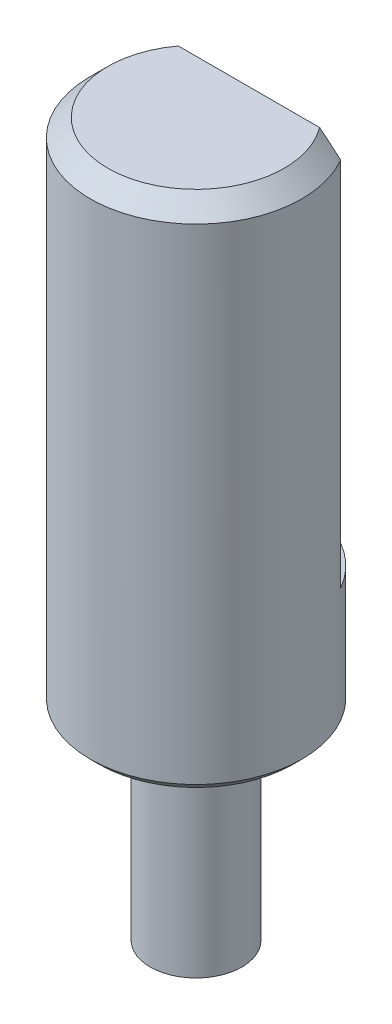
ISO-10303-21;
HEADER;
FILE_DESCRIPTION(('STEP AP214'),'2;1');
FILE_NAME('part.step','',(''),(''),'','','');
FILE_SCHEMA(('AUTOMOTIVE_DESIGN { 1 0 10303 214 1 1 1 1 }'));
ENDSEC;
DATA;
#1=APPLICATION_CONTEXT('core data for automotive mechanical design processes');
#2=APPLICATION_PROTOCOL_DEFINITION('international standard','automotive_design',2000,#1);
#3=PRODUCT_CONTEXT('',#1,'mechanical');
#4=PRODUCT('Part','Part','',(#3));
#5=PRODUCT_RELATED_PRODUCT_CATEGORY('part','',(#4));
#6=PRODUCT_DEFINITION_FORMATION('','',#4);
#7=PRODUCT_DEFINITION_CONTEXT('part definition',#1,'design');
#8=PRODUCT_DEFINITION('design','',#6,#7);
#9=PRODUCT_DEFINITION_SHAPE('','',#8);
#10=(LENGTH_UNIT() NAMED_UNIT(*) SI_UNIT(.MILLI.,.METRE.));
#11=(NAMED_UNIT(*) PLANE_ANGLE_UNIT() SI_UNIT($,.RADIAN.));
#12=(NAMED_UNIT(*) SI_UNIT($,.STERADIAN.) SOLID_ANGLE_UNIT());
#13=UNCERTAINTY_MEASURE_WITH_UNIT(LENGTH_MEASURE(1.E-05),#10,'distance_accuracy_value','');
#14=(GEOMETRIC_REPRESENTATION_CONTEXT(3) GLOBAL_UNCERTAINTY_ASSIGNED_CONTEXT((#13)) GLOBAL_UNIT_ASSIGNED_CONTEXT((#10,
#11,#12)) REPRESENTATION_CONTEXT('',''));
#15=CARTESIAN_POINT('',(0.,0.,0.));
#16=DIRECTION('',(0.,0.,1.));
#17=DIRECTION('',(1.,0.,0.));
#18=AXIS2_PLACEMENT_3D('',#15,#16,#17);
#19=CARTESIAN_POINT('',(0.,5.7,0.));
#20=DIRECTION('',(0.,-1.,0.));
#21=DIRECTION('',(0.,0.,-1.));
#22=AXIS2_PLACEMENT_3D('',#19,#20,#21);
#23=CYLINDRICAL_SURFACE('',#22,1.3);
#24=CARTESIAN_POINT('',(0.,5.7,0.));
#25=DIRECTION('',(0.,1.,0.));
#26=DIRECTION('',(0.,0.,1.));
#27=AXIS2_PLACEMENT_3D('',#24,#25,#26);
#28=CIRCLE('',#27,1.3);
#29=CARTESIAN_POINT('',(0.,5.7,1.3));
#30=VERTEX_POINT('',#29);
#31=EDGE_CURVE('E85',#30,#30,#28,.T.);
#32=ORIENTED_EDGE('',*,*,#31,.F.);
#33=EDGE_LOOP('',(#32));
#34=FACE_BOUND('',#33,.T.);
#35=CARTESIAN_POINT('',(0.,0.,0.));
#36=DIRECTION('',(0.,1.,0.));
#37=DIRECTION('',(0.,0.,1.));
#38=AXIS2_PLACEMENT_3D('',#35,#36,#37);
#39=CIRCLE('',#38,1.3);
#40=CARTESIAN_POINT('',(0.,0.,1.3));
#41=VERTEX_POINT('',#40);
#42=EDGE_CURVE('E81',#41,#41,#39,.T.);
#43=ORIENTED_EDGE('',*,*,#42,.T.);
#44=EDGE_LOOP('',(#43));
#45=FACE_BOUND('',#44,.T.);
#46=ADVANCED_FACE('F33',(#34,#45),#23,.T.);
#47=CARTESIAN_POINT('',(0.,0.,0.));
#48=DIRECTION('',(0.,1.,0.));
#49=DIRECTION('',(0.,0.,1.));
#50=AXIS2_PLACEMENT_3D('',#47,#48,#49);
#51=PLANE('',#50);
#52=ORIENTED_EDGE('',*,*,#42,.F.);
#53=EDGE_LOOP('',(#52));
#54=FACE_BOUND('',#53,.T.);
#55=ADVANCED_FACE('F123',(#54),#51,.F.);
#56=CARTESIAN_POINT('',(0.,20.2,0.));
#57=DIRECTION('',(0.,-1.,0.));
#58=DIRECTION('',(0.,0.,-1.));
#59=AXIS2_PLACEMENT_3D('',#56,#57,#58);
#60=CYLINDRICAL_SURFACE('',#59,3.);
#61=DIRECTION('',(0.,1.,0.));
#62=VECTOR('',#61,1.);
#63=CARTESIAN_POINT('',(2.59807621135332,9.2,-1.5));
#64=LINE('',#63,#62);
#65=CARTESIAN_POINT('',(2.59807621135332,9.2,-1.5));
#66=VERTEX_POINT('',#65);
#67=CARTESIAN_POINT('',(2.59807621135332,19.7,-1.5));
#68=VERTEX_POINT('',#67);
#69=EDGE_CURVE('E76',#66,#68,#64,.T.);
#70=ORIENTED_EDGE('',*,*,#69,.T.);
#71=CARTESIAN_POINT('',(0.,19.7,0.));
#72=DIRECTION('',(0.,1.,0.));
#73=DIRECTION('',(0.,0.,1.));
#74=AXIS2_PLACEMENT_3D('',#71,#72,#73);
#75=CIRCLE('',#74,3.);
#76=CARTESIAN_POINT('',(-2.59807621135332,19.7,-1.5));
#77=VERTEX_POINT('',#76);
#78=EDGE_CURVE('E11',#68,#77,#75,.F.);
#79=ORIENTED_EDGE('',*,*,#78,.T.);
#80=DIRECTION('',(0.,1.,0.));
#81=VECTOR('',#80,1.);
#82=CARTESIAN_POINT('',(-2.59807621135332,9.2,-1.5));
#83=LINE('',#82,#81);
#84=CARTESIAN_POINT('',(-2.59807621135332,9.2,-1.5));
#85=VERTEX_POINT('',#84);
#86=EDGE_CURVE('E74',#85,#77,#83,.T.);
#87=ORIENTED_EDGE('',*,*,#86,.F.);
#88=CARTESIAN_POINT('',(0.,9.2,0.));
#89=DIRECTION('',(0.,1.,0.));
#90=DIRECTION('',(0.,0.,1.));
#91=AXIS2_PLACEMENT_3D('',#88,#89,#90);
#92=CIRCLE('',#91,3.);
#93=EDGE_CURVE('E67',#66,#85,#92,.T.);
#94=ORIENTED_EDGE('',*,*,#93,.F.);
#95=EDGE_LOOP('',(#70,#79,#87,#94));
#96=FACE_BOUND('',#95,.T.);
#97=CARTESIAN_POINT('',(0.,5.95000000000001,0.));
#98=DIRECTION('',(0.,1.,0.));
#99=DIRECTION('',(0.,0.,1.));
#100=AXIS2_PLACEMENT_3D('',#97,#98,#99);
#101=CIRCLE('',#100,3.);
#102=CARTESIAN_POINT('',(0.,5.95000000000001,3.));
#103=VERTEX_POINT('',#102);
#104=EDGE_CURVE('E88',#103,#103,#101,.T.);
#105=ORIENTED_EDGE('',*,*,#104,.T.);
#106=EDGE_LOOP('',(#105));
#107=FACE_BOUND('',#106,.T.);
#108=ADVANCED_FACE('F78',(#96,#107),#60,.T.);
#109=CARTESIAN_POINT('',(0.,20.2,0.));
#110=DIRECTION('',(0.,1.,0.));
#111=DIRECTION('',(0.,0.,1.));
#112=AXIS2_PLACEMENT_3D('',#109,#110,#111);
#113=PLANE('',#112);
#114=DIRECTION('',(1.,0.,0.));
#115=VECTOR('',#114,1.);
#116=CARTESIAN_POINT('',(-2.59807621135332,20.2,-1.5));
#117=LINE('',#116,#115);
#118=CARTESIAN_POINT('',(-2.00000000000001,20.2,-1.5));
#119=VERTEX_POINT('',#118);
#120=CARTESIAN_POINT('',(2.00000000000001,20.2,-1.5));
#121=VERTEX_POINT('',#120);
#122=EDGE_CURVE('E71',#119,#121,#117,.T.);
#123=ORIENTED_EDGE('',*,*,#122,.F.);
#124=CARTESIAN_POINT('',(0.,20.2,0.));
#125=DIRECTION('',(0.,1.,0.));
#126=DIRECTION('',(0.,0.,1.));
#127=AXIS2_PLACEMENT_3D('',#124,#125,#126);
#128=CIRCLE('',#127,2.50000000000001);
#129=EDGE_CURVE('E96',#119,#121,#128,.T.);
#130=ORIENTED_EDGE('',*,*,#129,.T.);
#131=EDGE_LOOP('',(#123,#130));
#132=FACE_BOUND('',#131,.T.);
#133=ADVANCED_FACE('F112',(#132),#113,.T.);
#134=CARTESIAN_POINT('',(0.,5.7,0.));
#135=DIRECTION('',(0.,1.,0.));
#136=DIRECTION('',(0.,0.,1.));
#137=AXIS2_PLACEMENT_3D('',#134,#135,#136);
#138=PLANE('',#137);
#139=CARTESIAN_POINT('',(0.,5.7,0.));
#140=DIRECTION('',(0.,1.,0.));
#141=DIRECTION('',(0.,0.,1.));
#142=AXIS2_PLACEMENT_3D('',#139,#140,#141);
#143=CIRCLE('',#142,2.74999999999999);
#144=CARTESIAN_POINT('',(0.,5.7,2.74999999999999));
#145=VERTEX_POINT('',#144);
#146=EDGE_CURVE('E93',#145,#145,#143,.F.);
#147=ORIENTED_EDGE('',*,*,#146,.T.);
#148=EDGE_LOOP('',(#147));
#149=FACE_BOUND('',#148,.T.);
#150=ORIENTED_EDGE('',*,*,#31,.T.);
#151=EDGE_LOOP('',(#150));
#152=FACE_BOUND('',#151,.T.);
#153=ADVANCED_FACE('F116',(#149,#152),#138,.F.);
#154=CARTESIAN_POINT('',(0.,5.95000000000001,0.));
#155=DIRECTION('',(0.,1.,0.));
#156=DIRECTION('',(0.,0.,1.));
#157=AXIS2_PLACEMENT_3D('',#154,#155,#156);
#158=CONICAL_SURFACE('',#157,3.,0.785398163397448);
#159=ORIENTED_EDGE('',*,*,#146,.F.);
#160=EDGE_LOOP('',(#159));
#161=FACE_BOUND('',#160,.T.);
#162=ORIENTED_EDGE('',*,*,#104,.F.);
#163=EDGE_LOOP('',(#162));
#164=FACE_BOUND('',#163,.T.);
#165=ADVANCED_FACE('F111',(#161,#164),#158,.T.);
#166=CARTESIAN_POINT('',(-2.59807621135332,9.2,-1.5));
#167=DIRECTION('',(0.,0.,1.));
#168=DIRECTION('',(1.,0.,0.));
#169=AXIS2_PLACEMENT_3D('',#166,#167,#168);
#170=PLANE('',#169);
#171=ORIENTED_EDGE('',*,*,#122,.T.);
#172=CARTESIAN_POINT('',(2.00000000000001,20.2,-1.5));
#173=CARTESIAN_POINT('',(2.05073096834371,20.1594091541126,-1.5));
#174=CARTESIAN_POINT('',(2.10119559346293,20.1184877796223,-1.5));
#175=CARTESIAN_POINT('',(2.20165596476533,20.0360826364181,-1.5));
#176=CARTESIAN_POINT('',(2.25165175427951,19.9945989205613,-1.5));
#177=CARTESIAN_POINT('',(2.35124649520412,19.9111611597559,-1.5));
#178=CARTESIAN_POINT('',(2.40084545624944,19.8692071262861,-1.5));
#179=CARTESIAN_POINT('',(2.49970382878964,19.7848914399475,-1.5));
#180=CARTESIAN_POINT('',(2.54896320821956,19.7425297494666,-1.5));
#181=CARTESIAN_POINT('',(2.59807621135341,19.7000000000001,-1.5));
#182=B_SPLINE_CURVE_WITH_KNOTS('',3,(#172,#173,#174,#175,#176,#177,#178,#179,#180,#181),
.UNSPECIFIED.,.F.,.F.,(4,2,2,2,4),(0.,0.194909899355778,0.38980160348904,0.584688561258781,
0.779593675856239),.UNSPECIFIED.);
#183=EDGE_CURVE('E42',#121,#68,#182,.T.);
#184=ORIENTED_EDGE('',*,*,#183,.T.);
#185=ORIENTED_EDGE('',*,*,#69,.F.);
#186=DIRECTION('',(1.,0.,0.));
#187=VECTOR('',#186,1.);
#188=CARTESIAN_POINT('',(-2.59807621135332,9.2,-1.5));
#189=LINE('',#188,#187);
#190=EDGE_CURVE('E70',#85,#66,#189,.T.);
#191=ORIENTED_EDGE('',*,*,#190,.F.);
#192=ORIENTED_EDGE('',*,*,#86,.T.);
#193=CARTESIAN_POINT('',(-2.59807621135332,19.7,-1.5));
#194=CARTESIAN_POINT('',(-2.54896320821952,19.7425297494665,-1.5));
#195=CARTESIAN_POINT('',(-2.49970382878963,19.7848914399475,-1.5));
#196=CARTESIAN_POINT('',(-2.40084545624945,19.8692071262861,-1.5));
#197=CARTESIAN_POINT('',(-2.35124649520413,19.9111611597559,-1.5));
#198=CARTESIAN_POINT('',(-2.2516517542795,19.9945989205613,-1.5));
#199=CARTESIAN_POINT('',(-2.20165596476531,20.036082636418,-1.5));
#200=CARTESIAN_POINT('',(-2.10119559346297,20.1184877796224,-1.5));
#201=CARTESIAN_POINT('',(-2.05073096834384,20.1594091541128,-1.5));
#202=CARTESIAN_POINT('',(-2.00000000000032,20.2000000000004,-1.5));
#203=B_SPLINE_CURVE_WITH_KNOTS('',3,(#193,#194,#195,#196,#197,#198,#199,#200,#201,#202),
.UNSPECIFIED.,.F.,.F.,(4,2,2,2,4),(0.,0.194905114597462,0.389792072367198,0.584683776500454,
0.779593675856229),.UNSPECIFIED.);
#204=EDGE_CURVE('E99',#77,#119,#203,.T.);
#205=ORIENTED_EDGE('',*,*,#204,.T.);
#206=EDGE_LOOP('',(#171,#184,#185,#191,#192,#205));
#207=FACE_BOUND('',#206,.T.);
#208=ADVANCED_FACE('F73',(#207),#170,.F.);
#209=CARTESIAN_POINT('',(0.,9.2,0.));
#210=DIRECTION('',(0.,1.,0.));
#211=DIRECTION('',(0.,0.,1.));
#212=AXIS2_PLACEMENT_3D('',#209,#210,#211);
#213=PLANE('',#212);
#214=ORIENTED_EDGE('',*,*,#93,.T.);
#215=ORIENTED_EDGE('',*,*,#190,.T.);
#216=EDGE_LOOP('',(#214,#215));
#217=FACE_BOUND('',#216,.T.);
#218=ADVANCED_FACE('F69',(#217),#213,.T.);
#219=CARTESIAN_POINT('',(0.,20.2,0.));
#220=DIRECTION('',(0.,-1.,0.));
#221=DIRECTION('',(0.,0.,-1.));
#222=AXIS2_PLACEMENT_3D('',#219,#220,#221);
#223=CONICAL_SURFACE('',#222,2.50000000000001,0.785398163397447);
#224=ORIENTED_EDGE('',*,*,#204,.F.);
#225=ORIENTED_EDGE('',*,*,#78,.F.);
#226=ORIENTED_EDGE('',*,*,#183,.F.);
#227=ORIENTED_EDGE('',*,*,#129,.F.);
#228=EDGE_LOOP('',(#224,#225,#226,#227));
#229=FACE_BOUND('',#228,.T.);
#230=ADVANCED_FACE('F35',(#229),#223,.T.);
#231=CLOSED_SHELL('',(#46,#55,#108,#133,#153,#165,#208,#218,#230));
#232=MANIFOLD_SOLID_BREP('B2',#231);
#233=ADVANCED_BREP_SHAPE_REPRESENTATION('',(#18,#232),#14);
#234=SHAPE_DEFINITION_REPRESENTATION(#9,#233);
ENDSEC;
END-ISO-10303-21;
